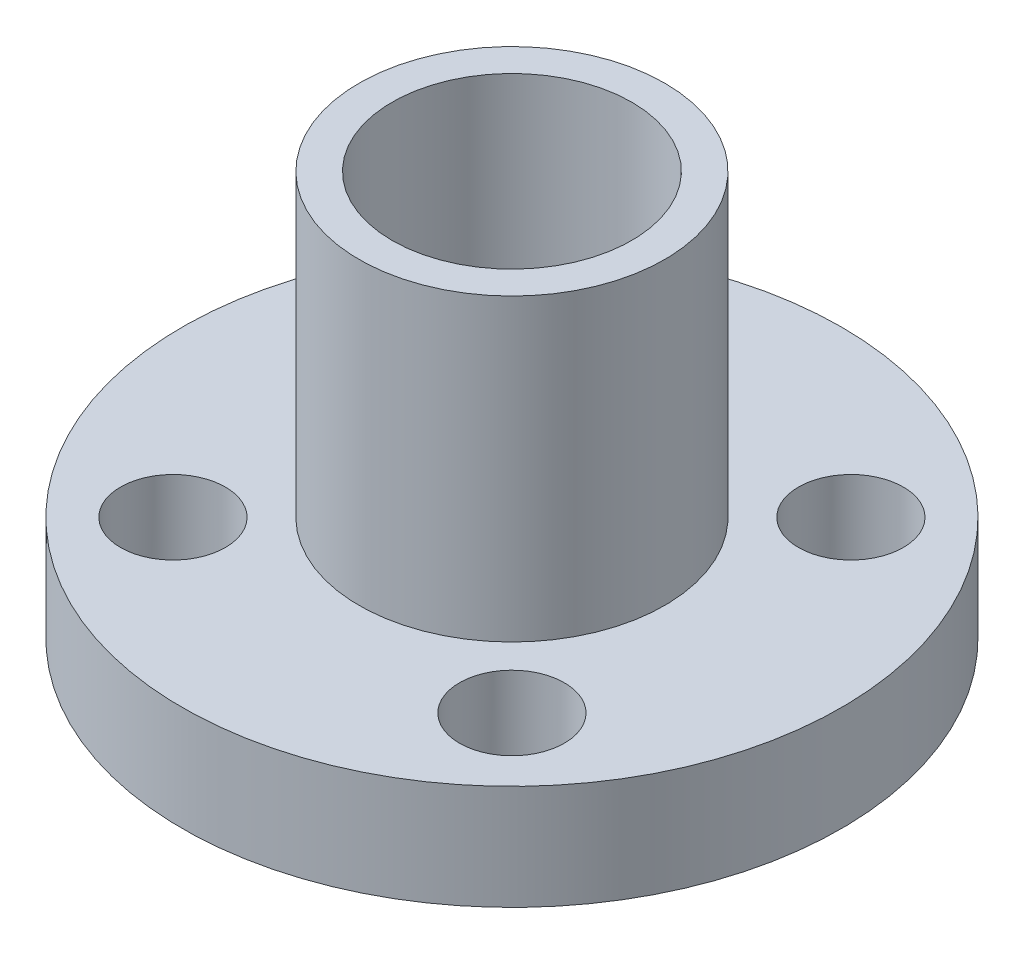
ISO-10303-21;
HEADER;
FILE_DESCRIPTION(('STEP AP214'),'2;1');
FILE_NAME('part.step','',(''),(''),'','','');
FILE_SCHEMA(('AUTOMOTIVE_DESIGN { 1 0 10303 214 1 1 1 1 }'));
ENDSEC;
DATA;
#1=APPLICATION_CONTEXT('core data for automotive mechanical design processes');
#2=APPLICATION_PROTOCOL_DEFINITION('international standard','automotive_design',2000,#1);
#3=PRODUCT_CONTEXT('',#1,'mechanical');
#4=PRODUCT('Part','Part','',(#3));
#5=PRODUCT_RELATED_PRODUCT_CATEGORY('part','',(#4));
#6=PRODUCT_DEFINITION_FORMATION('','',#4);
#7=PRODUCT_DEFINITION_CONTEXT('part definition',#1,'design');
#8=PRODUCT_DEFINITION('design','',#6,#7);
#9=PRODUCT_DEFINITION_SHAPE('','',#8);
#10=(LENGTH_UNIT() NAMED_UNIT(*) SI_UNIT(.MILLI.,.METRE.));
#11=(NAMED_UNIT(*) PLANE_ANGLE_UNIT() SI_UNIT($,.RADIAN.));
#12=(NAMED_UNIT(*) SI_UNIT($,.STERADIAN.) SOLID_ANGLE_UNIT());
#13=UNCERTAINTY_MEASURE_WITH_UNIT(LENGTH_MEASURE(1.E-05),#10,'distance_accuracy_value','');
#14=(GEOMETRIC_REPRESENTATION_CONTEXT(3) GLOBAL_UNCERTAINTY_ASSIGNED_CONTEXT((#13)) GLOBAL_UNIT_ASSIGNED_CONTEXT((#10,
#11,#12)) REPRESENTATION_CONTEXT('',''));
#15=CARTESIAN_POINT('',(0.,0.,0.));
#16=DIRECTION('',(0.,0.,1.));
#17=DIRECTION('',(1.,0.,0.));
#18=AXIS2_PLACEMENT_3D('',#15,#16,#17);
#19=CARTESIAN_POINT('',(5.1,0.,0.));
#20=DIRECTION('',(0.,-1.,0.));
#21=DIRECTION('',(0.,0.,-1.));
#22=AXIS2_PLACEMENT_3D('',#19,#20,#21);
#23=PLANE('',#22);
#24=CARTESIAN_POINT('',(0.,0.,0.));
#25=DIRECTION('',(0.,1.,0.));
#26=DIRECTION('',(0.,0.,1.));
#27=AXIS2_PLACEMENT_3D('',#24,#25,#26);
#28=CIRCLE('',#27,4.);
#29=CARTESIAN_POINT('',(0.,0.,4.));
#30=VERTEX_POINT('',#29);
#31=EDGE_CURVE('E80',#30,#30,#28,.T.);
#32=ORIENTED_EDGE('',*,*,#31,.T.);
#33=EDGE_LOOP('',(#32));
#34=FACE_BOUND('',#33,.T.);
#35=CARTESIAN_POINT('',(0.,0.,0.));
#36=DIRECTION('',(0.,-1.,0.));
#37=DIRECTION('',(0.,0.,-1.));
#38=AXIS2_PLACEMENT_3D('',#35,#36,#37);
#39=CIRCLE('',#38,5.1);
#40=CARTESIAN_POINT('',(0.,0.,-5.1));
#41=VERTEX_POINT('',#40);
#42=EDGE_CURVE('E53',#41,#41,#39,.T.);
#43=ORIENTED_EDGE('',*,*,#42,.T.);
#44=EDGE_LOOP('',(#43));
#45=FACE_BOUND('',#44,.T.);
#46=ADVANCED_FACE('F31',(#34,#45),#23,.T.);
#47=CARTESIAN_POINT('',(0.,15.,0.));
#48=DIRECTION('',(0.,1.,0.));
#49=DIRECTION('',(0.,0.,1.));
#50=AXIS2_PLACEMENT_3D('',#47,#48,#49);
#51=PLANE('',#50);
#52=CARTESIAN_POINT('',(0.,15.,0.));
#53=DIRECTION('',(0.,1.,0.));
#54=DIRECTION('',(0.,0.,1.));
#55=AXIS2_PLACEMENT_3D('',#52,#53,#54);
#56=CIRCLE('',#55,4.);
#57=CARTESIAN_POINT('',(0.,15.,4.));
#58=VERTEX_POINT('',#57);
#59=EDGE_CURVE('E83',#58,#58,#56,.T.);
#60=ORIENTED_EDGE('',*,*,#59,.F.);
#61=EDGE_LOOP('',(#60));
#62=FACE_BOUND('',#61,.T.);
#63=CARTESIAN_POINT('',(0.,15.,0.));
#64=DIRECTION('',(0.,-1.,0.));
#65=DIRECTION('',(0.,0.,-1.));
#66=AXIS2_PLACEMENT_3D('',#63,#64,#65);
#67=CIRCLE('',#66,5.1);
#68=CARTESIAN_POINT('',(0.,15.,-5.1));
#69=VERTEX_POINT('',#68);
#70=EDGE_CURVE('E10',#69,#69,#67,.T.);
#71=ORIENTED_EDGE('',*,*,#70,.F.);
#72=EDGE_LOOP('',(#71));
#73=FACE_BOUND('',#72,.T.);
#74=ADVANCED_FACE('F89',(#62,#73),#51,.T.);
#75=CARTESIAN_POINT('',(0.,0.,0.));
#76=DIRECTION('',(0.,-1.,0.));
#77=DIRECTION('',(0.,0.,-1.));
#78=AXIS2_PLACEMENT_3D('',#75,#76,#77);
#79=CYLINDRICAL_SURFACE('',#78,5.1);
#80=ORIENTED_EDGE('',*,*,#70,.T.);
#81=EDGE_LOOP('',(#80));
#82=FACE_BOUND('',#81,.T.);
#83=CARTESIAN_POINT('',(0.,5.,0.));
#84=DIRECTION('',(0.,-1.,0.));
#85=DIRECTION('',(0.,0.,-1.));
#86=AXIS2_PLACEMENT_3D('',#83,#84,#85);
#87=CIRCLE('',#86,5.1);
#88=CARTESIAN_POINT('',(0.,5.,-5.1));
#89=VERTEX_POINT('',#88);
#90=EDGE_CURVE('E37',#89,#89,#87,.T.);
#91=ORIENTED_EDGE('',*,*,#90,.F.);
#92=EDGE_LOOP('',(#91));
#93=FACE_BOUND('',#92,.T.);
#94=ADVANCED_FACE('F92',(#82,#93),#79,.T.);
#95=CARTESIAN_POINT('',(5.1,5.,0.));
#96=DIRECTION('',(0.,1.,0.));
#97=DIRECTION('',(0.,0.,1.));
#98=AXIS2_PLACEMENT_3D('',#95,#96,#97);
#99=PLANE('',#98);
#100=CARTESIAN_POINT('',(-5.65685424949238,5.,5.65685424949238));
#101=DIRECTION('',(0.,1.,0.));
#102=DIRECTION('',(0.,0.,1.));
#103=AXIS2_PLACEMENT_3D('',#100,#101,#102);
#104=CIRCLE('',#103,1.75);
#105=CARTESIAN_POINT('',(-5.65685424949238,5.,7.40685424949238));
#106=VERTEX_POINT('',#105);
#107=EDGE_CURVE('E77',#106,#106,#104,.T.);
#108=ORIENTED_EDGE('',*,*,#107,.F.);
#109=EDGE_LOOP('',(#108));
#110=FACE_BOUND('',#109,.T.);
#111=CARTESIAN_POINT('',(5.65685424949238,5.,5.65685424949238));
#112=DIRECTION('',(0.,1.,0.));
#113=DIRECTION('',(0.,0.,1.));
#114=AXIS2_PLACEMENT_3D('',#111,#112,#113);
#115=CIRCLE('',#114,1.75);
#116=CARTESIAN_POINT('',(5.65685424949238,5.,7.40685424949238));
#117=VERTEX_POINT('',#116);
#118=EDGE_CURVE('E71',#117,#117,#115,.T.);
#119=ORIENTED_EDGE('',*,*,#118,.F.);
#120=EDGE_LOOP('',(#119));
#121=FACE_BOUND('',#120,.T.);
#122=CARTESIAN_POINT('',(5.65685424949238,5.,-5.65685424949238));
#123=DIRECTION('',(0.,1.,0.));
#124=DIRECTION('',(0.,0.,1.));
#125=AXIS2_PLACEMENT_3D('',#122,#123,#124);
#126=CIRCLE('',#125,1.75);
#127=CARTESIAN_POINT('',(5.65685424949238,5.,-3.90685424949238));
#128=VERTEX_POINT('',#127);
#129=EDGE_CURVE('E65',#128,#128,#126,.T.);
#130=ORIENTED_EDGE('',*,*,#129,.F.);
#131=EDGE_LOOP('',(#130));
#132=FACE_BOUND('',#131,.T.);
#133=CARTESIAN_POINT('',(-5.65685424949238,5.,-5.65685424949238));
#134=DIRECTION('',(0.,1.,0.));
#135=DIRECTION('',(0.,0.,1.));
#136=AXIS2_PLACEMENT_3D('',#133,#134,#135);
#137=CIRCLE('',#136,1.75);
#138=CARTESIAN_POINT('',(-5.65685424949238,5.,-3.90685424949238));
#139=VERTEX_POINT('',#138);
#140=EDGE_CURVE('E59',#139,#139,#137,.T.);
#141=ORIENTED_EDGE('',*,*,#140,.F.);
#142=EDGE_LOOP('',(#141));
#143=FACE_BOUND('',#142,.T.);
#144=ORIENTED_EDGE('',*,*,#90,.T.);
#145=EDGE_LOOP('',(#144));
#146=FACE_BOUND('',#145,.T.);
#147=CARTESIAN_POINT('',(0.,5.,0.));
#148=DIRECTION('',(0.,-1.,0.));
#149=DIRECTION('',(0.,0.,-1.));
#150=AXIS2_PLACEMENT_3D('',#147,#148,#149);
#151=CIRCLE('',#150,11.);
#152=CARTESIAN_POINT('',(0.,5.,-11.));
#153=VERTEX_POINT('',#152);
#154=EDGE_CURVE('E41',#153,#153,#151,.T.);
#155=ORIENTED_EDGE('',*,*,#154,.F.);
#156=EDGE_LOOP('',(#155));
#157=FACE_BOUND('',#156,.T.);
#158=ADVANCED_FACE('F97',(#110,#121,#132,#143,#146,#157),#99,.T.);
#159=CARTESIAN_POINT('',(0.,0.,0.));
#160=DIRECTION('',(0.,-1.,0.));
#161=DIRECTION('',(0.,0.,-1.));
#162=AXIS2_PLACEMENT_3D('',#159,#160,#161);
#163=CYLINDRICAL_SURFACE('',#162,11.);
#164=ORIENTED_EDGE('',*,*,#154,.T.);
#165=EDGE_LOOP('',(#164));
#166=FACE_BOUND('',#165,.T.);
#167=CARTESIAN_POINT('',(0.,1.5,0.));
#168=DIRECTION('',(0.,-1.,0.));
#169=DIRECTION('',(0.,0.,-1.));
#170=AXIS2_PLACEMENT_3D('',#167,#168,#169);
#171=CIRCLE('',#170,11.);
#172=CARTESIAN_POINT('',(0.,1.5,-11.));
#173=VERTEX_POINT('',#172);
#174=EDGE_CURVE('E45',#173,#173,#171,.T.);
#175=ORIENTED_EDGE('',*,*,#174,.F.);
#176=EDGE_LOOP('',(#175));
#177=FACE_BOUND('',#176,.T.);
#178=ADVANCED_FACE('F103',(#166,#177),#163,.T.);
#179=CARTESIAN_POINT('',(11.,1.5,0.));
#180=DIRECTION('',(0.,-1.,0.));
#181=DIRECTION('',(0.,0.,-1.));
#182=AXIS2_PLACEMENT_3D('',#179,#180,#181);
#183=PLANE('',#182);
#184=CARTESIAN_POINT('',(-5.65685424949238,1.5,5.65685424949238));
#185=DIRECTION('',(0.,-1.,0.));
#186=DIRECTION('',(0.,0.,-1.));
#187=AXIS2_PLACEMENT_3D('',#184,#185,#186);
#188=CIRCLE('',#187,1.75);
#189=CARTESIAN_POINT('',(-5.65685424949238,1.5,3.90685424949238));
#190=VERTEX_POINT('',#189);
#191=EDGE_CURVE('E74',#190,#190,#188,.T.);
#192=ORIENTED_EDGE('',*,*,#191,.F.);
#193=EDGE_LOOP('',(#192));
#194=FACE_BOUND('',#193,.T.);
#195=CARTESIAN_POINT('',(5.65685424949238,1.5,5.65685424949238));
#196=DIRECTION('',(0.,-1.,0.));
#197=DIRECTION('',(0.,0.,-1.));
#198=AXIS2_PLACEMENT_3D('',#195,#196,#197);
#199=CIRCLE('',#198,1.75);
#200=CARTESIAN_POINT('',(5.65685424949238,1.5,3.90685424949238));
#201=VERTEX_POINT('',#200);
#202=EDGE_CURVE('E68',#201,#201,#199,.T.);
#203=ORIENTED_EDGE('',*,*,#202,.F.);
#204=EDGE_LOOP('',(#203));
#205=FACE_BOUND('',#204,.T.);
#206=CARTESIAN_POINT('',(5.65685424949238,1.5,-5.65685424949238));
#207=DIRECTION('',(0.,-1.,0.));
#208=DIRECTION('',(0.,0.,-1.));
#209=AXIS2_PLACEMENT_3D('',#206,#207,#208);
#210=CIRCLE('',#209,1.75);
#211=CARTESIAN_POINT('',(5.65685424949238,1.5,-7.40685424949238));
#212=VERTEX_POINT('',#211);
#213=EDGE_CURVE('E62',#212,#212,#210,.T.);
#214=ORIENTED_EDGE('',*,*,#213,.F.);
#215=EDGE_LOOP('',(#214));
#216=FACE_BOUND('',#215,.T.);
#217=CARTESIAN_POINT('',(-5.65685424949238,1.5,-5.65685424949238));
#218=DIRECTION('',(0.,-1.,0.));
#219=DIRECTION('',(0.,0.,-1.));
#220=AXIS2_PLACEMENT_3D('',#217,#218,#219);
#221=CIRCLE('',#220,1.75);
#222=CARTESIAN_POINT('',(-5.65685424949238,1.5,-7.40685424949238));
#223=VERTEX_POINT('',#222);
#224=EDGE_CURVE('E56',#223,#223,#221,.T.);
#225=ORIENTED_EDGE('',*,*,#224,.F.);
#226=EDGE_LOOP('',(#225));
#227=FACE_BOUND('',#226,.T.);
#228=ORIENTED_EDGE('',*,*,#174,.T.);
#229=EDGE_LOOP('',(#228));
#230=FACE_BOUND('',#229,.T.);
#231=CARTESIAN_POINT('',(0.,1.5,0.));
#232=DIRECTION('',(0.,-1.,0.));
#233=DIRECTION('',(0.,0.,-1.));
#234=AXIS2_PLACEMENT_3D('',#231,#232,#233);
#235=CIRCLE('',#234,5.1);
#236=CARTESIAN_POINT('',(0.,1.5,-5.1));
#237=VERTEX_POINT('',#236);
#238=EDGE_CURVE('E50',#237,#237,#235,.T.);
#239=ORIENTED_EDGE('',*,*,#238,.F.);
#240=EDGE_LOOP('',(#239));
#241=FACE_BOUND('',#240,.T.);
#242=ADVANCED_FACE('F107',(#194,#205,#216,#227,#230,#241),#183,.T.);
#243=CARTESIAN_POINT('',(0.,0.,0.));
#244=DIRECTION('',(0.,-1.,0.));
#245=DIRECTION('',(0.,0.,-1.));
#246=AXIS2_PLACEMENT_3D('',#243,#244,#245);
#247=CYLINDRICAL_SURFACE('',#246,5.1);
#248=ORIENTED_EDGE('',*,*,#238,.T.);
#249=EDGE_LOOP('',(#248));
#250=FACE_BOUND('',#249,.T.);
#251=ORIENTED_EDGE('',*,*,#42,.F.);
#252=EDGE_LOOP('',(#251));
#253=FACE_BOUND('',#252,.T.);
#254=ADVANCED_FACE('F111',(#250,#253),#247,.T.);
#255=CARTESIAN_POINT('',(-5.65685424949238,5.,-5.65685424949238));
#256=DIRECTION('',(0.,1.,0.));
#257=DIRECTION('',(0.,0.,1.));
#258=AXIS2_PLACEMENT_3D('',#255,#256,#257);
#259=CYLINDRICAL_SURFACE('',#258,1.75);
#260=ORIENTED_EDGE('',*,*,#224,.T.);
#261=EDGE_LOOP('',(#260));
#262=FACE_BOUND('',#261,.T.);
#263=ORIENTED_EDGE('',*,*,#140,.T.);
#264=EDGE_LOOP('',(#263));
#265=FACE_BOUND('',#264,.T.);
#266=ADVANCED_FACE('F115',(#262,#265),#259,.F.);
#267=CARTESIAN_POINT('',(5.65685424949238,5.,-5.65685424949238));
#268=DIRECTION('',(0.,1.,0.));
#269=DIRECTION('',(0.,0.,1.));
#270=AXIS2_PLACEMENT_3D('',#267,#268,#269);
#271=CYLINDRICAL_SURFACE('',#270,1.75);
#272=ORIENTED_EDGE('',*,*,#213,.T.);
#273=EDGE_LOOP('',(#272));
#274=FACE_BOUND('',#273,.T.);
#275=ORIENTED_EDGE('',*,*,#129,.T.);
#276=EDGE_LOOP('',(#275));
#277=FACE_BOUND('',#276,.T.);
#278=ADVANCED_FACE('F119',(#274,#277),#271,.F.);
#279=CARTESIAN_POINT('',(5.65685424949238,5.,5.65685424949238));
#280=DIRECTION('',(0.,1.,0.));
#281=DIRECTION('',(0.,0.,1.));
#282=AXIS2_PLACEMENT_3D('',#279,#280,#281);
#283=CYLINDRICAL_SURFACE('',#282,1.75);
#284=ORIENTED_EDGE('',*,*,#202,.T.);
#285=EDGE_LOOP('',(#284));
#286=FACE_BOUND('',#285,.T.);
#287=ORIENTED_EDGE('',*,*,#118,.T.);
#288=EDGE_LOOP('',(#287));
#289=FACE_BOUND('',#288,.T.);
#290=ADVANCED_FACE('F123',(#286,#289),#283,.F.);
#291=CARTESIAN_POINT('',(-5.65685424949238,5.,5.65685424949238));
#292=DIRECTION('',(0.,1.,0.));
#293=DIRECTION('',(0.,0.,1.));
#294=AXIS2_PLACEMENT_3D('',#291,#292,#293);
#295=CYLINDRICAL_SURFACE('',#294,1.75);
#296=ORIENTED_EDGE('',*,*,#191,.T.);
#297=EDGE_LOOP('',(#296));
#298=FACE_BOUND('',#297,.T.);
#299=ORIENTED_EDGE('',*,*,#107,.T.);
#300=EDGE_LOOP('',(#299));
#301=FACE_BOUND('',#300,.T.);
#302=ADVANCED_FACE('F127',(#298,#301),#295,.F.);
#303=CARTESIAN_POINT('',(0.,15.,0.));
#304=DIRECTION('',(0.,1.,0.));
#305=DIRECTION('',(0.,0.,1.));
#306=AXIS2_PLACEMENT_3D('',#303,#304,#305);
#307=CYLINDRICAL_SURFACE('',#306,4.);
#308=ORIENTED_EDGE('',*,*,#31,.F.);
#309=EDGE_LOOP('',(#308));
#310=FACE_BOUND('',#309,.T.);
#311=ORIENTED_EDGE('',*,*,#59,.T.);
#312=EDGE_LOOP('',(#311));
#313=FACE_BOUND('',#312,.T.);
#314=ADVANCED_FACE('F87',(#310,#313),#307,.F.);
#315=CLOSED_SHELL('',(#46,#74,#94,#158,#178,#242,#254,#266,#278,#290,#302,#314));
#316=MANIFOLD_SOLID_BREP('B2',#315);
#317=ADVANCED_BREP_SHAPE_REPRESENTATION('',(#18,#316),#14);
#318=SHAPE_DEFINITION_REPRESENTATION(#9,#317);
ENDSEC;
END-ISO-10303-21;
